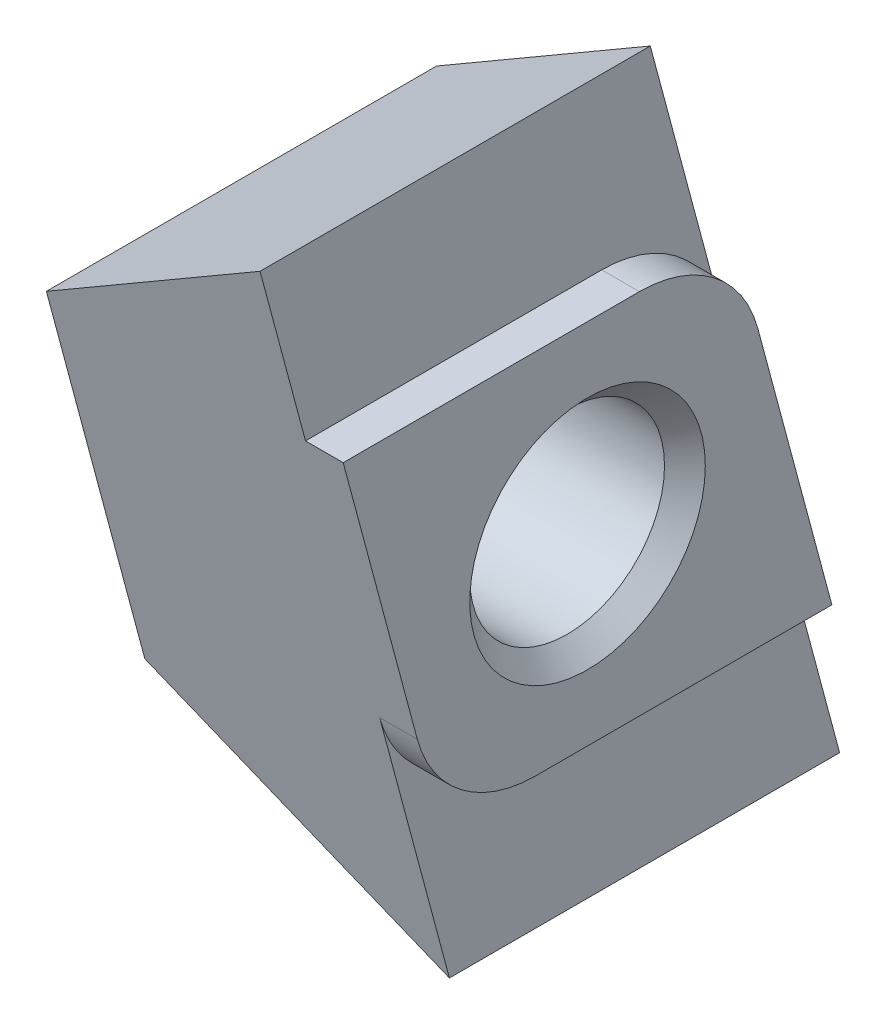
ISO-10303-21;
HEADER;
FILE_DESCRIPTION(('STEP AP214'),'2;1');
FILE_NAME('part.step','',(''),(''),'','','');
FILE_SCHEMA(('AUTOMOTIVE_DESIGN { 1 0 10303 214 1 1 1 1 }'));
ENDSEC;
DATA;
#1=APPLICATION_CONTEXT('core data for automotive mechanical design processes');
#2=APPLICATION_PROTOCOL_DEFINITION('international standard','automotive_design',2000,#1);
#3=PRODUCT_CONTEXT('',#1,'mechanical');
#4=PRODUCT('Part','Part','',(#3));
#5=PRODUCT_RELATED_PRODUCT_CATEGORY('part','',(#4));
#6=PRODUCT_DEFINITION_FORMATION('','',#4);
#7=PRODUCT_DEFINITION_CONTEXT('part definition',#1,'design');
#8=PRODUCT_DEFINITION('design','',#6,#7);
#9=PRODUCT_DEFINITION_SHAPE('','',#8);
#10=(LENGTH_UNIT() NAMED_UNIT(*) SI_UNIT(.MILLI.,.METRE.));
#11=(NAMED_UNIT(*) PLANE_ANGLE_UNIT() SI_UNIT($,.RADIAN.));
#12=(NAMED_UNIT(*) SI_UNIT($,.STERADIAN.) SOLID_ANGLE_UNIT());
#13=UNCERTAINTY_MEASURE_WITH_UNIT(LENGTH_MEASURE(1.E-05),#10,'distance_accuracy_value','');
#14=(GEOMETRIC_REPRESENTATION_CONTEXT(3) GLOBAL_UNCERTAINTY_ASSIGNED_CONTEXT((#13)) GLOBAL_UNIT_ASSIGNED_CONTEXT((#10,
#11,#12)) REPRESENTATION_CONTEXT('',''));
#15=CARTESIAN_POINT('',(0.,0.,0.));
#16=DIRECTION('',(0.,0.,1.));
#17=DIRECTION('',(1.,0.,0.));
#18=AXIS2_PLACEMENT_3D('',#15,#16,#17);
#19=CARTESIAN_POINT('',(-0.800000000000001,1.29999999999999,-1.10105270241365));
#20=DIRECTION('',(1.,0.,0.));
#21=DIRECTION('',(0.,0.,-1.));
#22=AXIS2_PLACEMENT_3D('',#19,#20,#21);
#23=CYLINDRICAL_SURFACE('',#22,2.60000000000001);
#24=CARTESIAN_POINT('',(0.,1.29999999999999,-1.10105270241365));
#25=DIRECTION('',(1.,0.,0.));
#26=DIRECTION('',(0.,0.,-1.));
#27=AXIS2_PLACEMENT_3D('',#24,#25,#26);
#28=CIRCLE('',#27,2.60000000000001);
#29=CARTESIAN_POINT('',(0.,1.97292951726655,-3.61245985076524));
#30=VERTEX_POINT('',#29);
#31=CARTESIAN_POINT('',(0.,3.9,-1.10105270241365));
#32=VERTEX_POINT('',#31);
#33=EDGE_CURVE('E150',#30,#32,#28,.T.);
#34=ORIENTED_EDGE('',*,*,#33,.F.);
#35=DIRECTION('',(1.,0.,0.));
#36=VECTOR('',#35,1.);
#37=CARTESIAN_POINT('',(-0.800000000000001,1.97292951726655,-3.61245985076524));
#38=LINE('',#37,#36);
#39=CARTESIAN_POINT('',(-0.800000000000001,1.97292951726655,-3.61245985076523));
#40=VERTEX_POINT('',#39);
#41=EDGE_CURVE('E168',#40,#30,#38,.T.);
#42=ORIENTED_EDGE('',*,*,#41,.F.);
#43=CARTESIAN_POINT('',(-0.800000000000001,1.29999999999999,-1.10105270241365));
#44=DIRECTION('',(1.,0.,0.));
#45=DIRECTION('',(0.,0.,-1.));
#46=AXIS2_PLACEMENT_3D('',#43,#44,#45);
#47=CIRCLE('',#46,2.60000000000001);
#48=CARTESIAN_POINT('',(-0.800000000000001,3.9,-1.10105270241365));
#49=VERTEX_POINT('',#48);
#50=EDGE_CURVE('E136',#40,#49,#47,.T.);
#51=ORIENTED_EDGE('',*,*,#50,.T.);
#52=DIRECTION('',(1.,0.,0.));
#53=VECTOR('',#52,1.);
#54=CARTESIAN_POINT('',(-0.800000000000001,3.9,-1.10105270241365));
#55=LINE('',#54,#53);
#56=EDGE_CURVE('E120',#49,#32,#55,.T.);
#57=ORIENTED_EDGE('',*,*,#56,.T.);
#58=EDGE_LOOP('',(#34,#42,#51,#57));
#59=FACE_BOUND('',#58,.T.);
#60=ADVANCED_FACE('F33',(#59),#23,.T.);
#61=CARTESIAN_POINT('',(-0.800000000000001,-3.9,-5.18610657212171));
#62=DIRECTION('',(0.,0.25881904510252,-0.965925826289068));
#63=DIRECTION('',(0.,0.965925826289068,0.25881904510252));
#64=AXIS2_PLACEMENT_3D('',#61,#62,#63);
#65=PLANE('',#64);
#66=DIRECTION('',(0.,0.965925826289068,0.25881904510252));
#67=VECTOR('',#66,1.);
#68=CARTESIAN_POINT('',(0.,-3.9,-5.18610657212171));
#69=LINE('',#68,#67);
#70=CARTESIAN_POINT('',(0.,-3.9,-5.18610657212171));
#71=VERTEX_POINT('',#70);
#72=EDGE_CURVE('E274',#71,#30,#69,.T.);
#73=ORIENTED_EDGE('',*,*,#72,.F.);
#74=DIRECTION('',(1.,0.,0.));
#75=VECTOR('',#74,1.);
#76=CARTESIAN_POINT('',(-0.800000000000001,-3.9,-5.18610657212171));
#77=LINE('',#76,#75);
#78=CARTESIAN_POINT('',(-0.800000000000001,-3.9,-5.18610657212171));
#79=VERTEX_POINT('',#78);
#80=EDGE_CURVE('E130',#79,#71,#77,.T.);
#81=ORIENTED_EDGE('',*,*,#80,.F.);
#82=CARTESIAN_POINT('',(-0.800000000000001,7.5,-2.13148577840691));
#83=CARTESIAN_POINT('',(-0.800000000000001,2.5,-3.47123174056252));
#84=CARTESIAN_POINT('',(-0.800000000000001,-2.5,-4.81097770271814));
#85=CARTESIAN_POINT('',(-0.800000000000001,-7.5,-6.15072366487375));
#86=B_SPLINE_CURVE_WITH_KNOTS('',3,(#82,#83,#84,#85),.UNSPECIFIED.,.F.,.F.,(4,4),(0.,1.),.UNSPECIFIED.);
#87=CARTESIAN_POINT('',(-0.800000000000001,-7.5,-6.15072366487375));
#88=VERTEX_POINT('',#87);
#89=EDGE_CURVE('E117',#79,#88,#86,.T.);
#90=ORIENTED_EDGE('',*,*,#89,.T.);
#91=DIRECTION('',(-0.827835666345006,0.541856072516727,0.145189897044757));
#92=VECTOR('',#91,1.);
#93=CARTESIAN_POINT('',(-2.53078460239917,-6.36712280570237,-5.84717013553806));
#94=LINE('',#93,#92);
#95=CARTESIAN_POINT('',(-6.3,-3.90000000000003,-5.18610657212172));
#96=VERTEX_POINT('',#95);
#97=EDGE_CURVE('E157',#96,#88,#94,.F.);
#98=ORIENTED_EDGE('',*,*,#97,.F.);
#99=CARTESIAN_POINT('',(-6.3,7.5,-2.13148577840691));
#100=CARTESIAN_POINT('',(-6.3,2.5,-3.47123174056252));
#101=CARTESIAN_POINT('',(-6.3,-2.5,-4.81097770271814));
#102=CARTESIAN_POINT('',(-6.3,-7.5,-6.15072366487375));
#103=B_SPLINE_CURVE_WITH_KNOTS('',3,(#99,#100,#101,#102),.UNSPECIFIED.,.F.,.F.,(4,4),(0.,1.),.UNSPECIFIED.);
#104=CARTESIAN_POINT('',(-6.3,3.90000000000003,-3.09610287115894));
#105=VERTEX_POINT('',#104);
#106=EDGE_CURVE('E84',#105,#96,#103,.T.);
#107=ORIENTED_EDGE('',*,*,#106,.F.);
#108=DIRECTION('',(-0.827835666345006,-0.541856072516727,-0.145189897044757));
#109=VECTOR('',#108,1.);
#110=CARTESIAN_POINT('',(-0.8,7.5,-2.13148577840691));
#111=LINE('',#110,#109);
#112=CARTESIAN_POINT('',(-0.800000000000001,7.5,-2.13148577840691));
#113=VERTEX_POINT('',#112);
#114=EDGE_CURVE('E151',#105,#113,#111,.F.);
#115=ORIENTED_EDGE('',*,*,#114,.T.);
#116=EDGE_CURVE('E224',#113,#40,#86,.T.);
#117=ORIENTED_EDGE('',*,*,#116,.T.);
#118=ORIENTED_EDGE('',*,*,#41,.T.);
#119=EDGE_LOOP('',(#73,#81,#90,#98,#107,#115,#117,#118));
#120=FACE_BOUND('',#119,.T.);
#121=ADVANCED_FACE('F194',(#120),#65,.T.);
#122=CARTESIAN_POINT('',(-0.800000000000001,-3.9,1.10105270241365));
#123=DIRECTION('',(0.,-1.,0.));
#124=DIRECTION('',(0.,0.,-1.));
#125=AXIS2_PLACEMENT_3D('',#122,#123,#124);
#126=PLANE('',#125);
#127=DIRECTION('',(0.,0.,-1.));
#128=VECTOR('',#127,1.);
#129=CARTESIAN_POINT('',(0.,-3.9,1.10105270241365));
#130=LINE('',#129,#128);
#131=CARTESIAN_POINT('',(0.,-3.9,1.10105270241365));
#132=VERTEX_POINT('',#131);
#133=EDGE_CURVE('E126',#132,#71,#130,.T.);
#134=ORIENTED_EDGE('',*,*,#133,.F.);
#135=DIRECTION('',(1.,0.,0.));
#136=VECTOR('',#135,1.);
#137=CARTESIAN_POINT('',(-0.800000000000001,-3.9,1.10105270241365));
#138=LINE('',#137,#136);
#139=CARTESIAN_POINT('',(-0.800000000000001,-3.9,1.10105270241365));
#140=VERTEX_POINT('',#139);
#141=EDGE_CURVE('E123',#140,#132,#138,.T.);
#142=ORIENTED_EDGE('',*,*,#141,.F.);
#143=DIRECTION('',(0.,0.,-1.));
#144=VECTOR('',#143,1.);
#145=CARTESIAN_POINT('',(-0.800000000000001,-3.9,1.10105270241365));
#146=LINE('',#145,#144);
#147=EDGE_CURVE('E112',#140,#79,#146,.T.);
#148=ORIENTED_EDGE('',*,*,#147,.T.);
#149=ORIENTED_EDGE('',*,*,#80,.T.);
#150=EDGE_LOOP('',(#134,#142,#148,#149));
#151=FACE_BOUND('',#150,.T.);
#152=ADVANCED_FACE('F124',(#151),#126,.T.);
#153=CARTESIAN_POINT('',(-0.800000000000001,-1.3,1.10105270241365));
#154=DIRECTION('',(1.,0.,0.));
#155=DIRECTION('',(0.,0.,-1.));
#156=AXIS2_PLACEMENT_3D('',#153,#154,#155);
#157=CYLINDRICAL_SURFACE('',#156,2.6);
#158=CARTESIAN_POINT('',(0.,-1.3,1.10105270241365));
#159=DIRECTION('',(1.,0.,0.));
#160=DIRECTION('',(0.,0.,-1.));
#161=AXIS2_PLACEMENT_3D('',#158,#159,#160);
#162=CIRCLE('',#161,2.6);
#163=CARTESIAN_POINT('',(0.,-1.97292951726655,3.61245985076523));
#164=VERTEX_POINT('',#163);
#165=EDGE_CURVE('E288',#164,#132,#162,.T.);
#166=ORIENTED_EDGE('',*,*,#165,.F.);
#167=DIRECTION('',(1.,0.,0.));
#168=VECTOR('',#167,1.);
#169=CARTESIAN_POINT('',(-0.800000000000001,-1.97292951726655,3.61245985076523));
#170=LINE('',#169,#168);
#171=CARTESIAN_POINT('',(-0.800000000000001,-1.97292951726656,3.61245985076523));
#172=VERTEX_POINT('',#171);
#173=EDGE_CURVE('E131',#172,#164,#170,.T.);
#174=ORIENTED_EDGE('',*,*,#173,.F.);
#175=CARTESIAN_POINT('',(-0.800000000000001,-1.3,1.10105270241365));
#176=DIRECTION('',(1.,0.,0.));
#177=DIRECTION('',(0.,0.,-1.));
#178=AXIS2_PLACEMENT_3D('',#175,#176,#177);
#179=CIRCLE('',#178,2.6);
#180=EDGE_CURVE('E98',#172,#140,#179,.T.);
#181=ORIENTED_EDGE('',*,*,#180,.T.);
#182=ORIENTED_EDGE('',*,*,#141,.T.);
#183=EDGE_LOOP('',(#166,#174,#181,#182));
#184=FACE_BOUND('',#183,.T.);
#185=ADVANCED_FACE('F134',(#184),#157,.T.);
#186=CARTESIAN_POINT('',(-0.800000000000001,3.9,5.18610657212171));
#187=DIRECTION('',(0.,-0.258819045102521,0.965925826289068));
#188=DIRECTION('',(0.,-0.965925826289068,-0.258819045102521));
#189=AXIS2_PLACEMENT_3D('',#186,#187,#188);
#190=PLANE('',#189);
#191=DIRECTION('',(0.,-0.965925826289068,-0.258819045102521));
#192=VECTOR('',#191,1.);
#193=CARTESIAN_POINT('',(0.,3.9,5.18610657212171));
#194=LINE('',#193,#192);
#195=CARTESIAN_POINT('',(0.,3.9,5.18610657212171));
#196=VERTEX_POINT('',#195);
#197=EDGE_CURVE('E294',#196,#164,#194,.T.);
#198=ORIENTED_EDGE('',*,*,#197,.F.);
#199=DIRECTION('',(1.,0.,0.));
#200=VECTOR('',#199,1.);
#201=CARTESIAN_POINT('',(-0.800000000000001,3.9,5.18610657212171));
#202=LINE('',#201,#200);
#203=CARTESIAN_POINT('',(-0.800000000000001,3.9,5.18610657212171));
#204=VERTEX_POINT('',#203);
#205=EDGE_CURVE('E144',#204,#196,#202,.T.);
#206=ORIENTED_EDGE('',*,*,#205,.F.);
#207=CARTESIAN_POINT('',(-0.800000000000001,-7.5,2.13148577840691));
#208=CARTESIAN_POINT('',(-0.800000000000001,-2.5,3.47123174056252));
#209=CARTESIAN_POINT('',(-0.800000000000001,2.5,4.81097770271814));
#210=CARTESIAN_POINT('',(-0.800000000000001,7.5,6.15072366487375));
#211=B_SPLINE_CURVE_WITH_KNOTS('',3,(#207,#208,#209,#210),.UNSPECIFIED.,.F.,.F.,(4,4),(0.,1.),.UNSPECIFIED.);
#212=CARTESIAN_POINT('',(-0.800000000000001,7.5,6.15072366487375));
#213=VERTEX_POINT('',#212);
#214=EDGE_CURVE('E50',#204,#213,#211,.T.);
#215=ORIENTED_EDGE('',*,*,#214,.T.);
#216=DIRECTION('',(-0.827835666345006,-0.541856072516727,-0.145189897044757));
#217=VECTOR('',#216,1.);
#218=CARTESIAN_POINT('',(-2.53078460239917,6.36712280570237,5.84717013553807));
#219=LINE('',#218,#217);
#220=CARTESIAN_POINT('',(-6.3,3.90000000000003,5.18610657212172));
#221=VERTEX_POINT('',#220);
#222=EDGE_CURVE('E147',#221,#213,#219,.F.);
#223=ORIENTED_EDGE('',*,*,#222,.F.);
#224=CARTESIAN_POINT('',(-6.3,-7.5,2.13148577840691));
#225=CARTESIAN_POINT('',(-6.3,-2.5,3.47123174056252));
#226=CARTESIAN_POINT('',(-6.3,2.5,4.81097770271814));
#227=CARTESIAN_POINT('',(-6.3,7.5,6.15072366487375));
#228=B_SPLINE_CURVE_WITH_KNOTS('',3,(#224,#225,#226,#227),.UNSPECIFIED.,.F.,.F.,(4,4),(0.,1.),.UNSPECIFIED.);
#229=CARTESIAN_POINT('',(-6.3,-3.90000000000003,3.09610287115894));
#230=VERTEX_POINT('',#229);
#231=EDGE_CURVE('E154',#230,#221,#228,.T.);
#232=ORIENTED_EDGE('',*,*,#231,.F.);
#233=DIRECTION('',(-0.827835666345006,0.541856072516727,0.145189897044757));
#234=VECTOR('',#233,1.);
#235=CARTESIAN_POINT('',(-0.800000000000001,-7.5,2.1314857784069));
#236=LINE('',#235,#234);
#237=CARTESIAN_POINT('',(-0.800000000000001,-7.5,2.13148577840691));
#238=VERTEX_POINT('',#237);
#239=EDGE_CURVE('E160',#230,#238,#236,.F.);
#240=ORIENTED_EDGE('',*,*,#239,.T.);
#241=EDGE_CURVE('E229',#238,#172,#211,.T.);
#242=ORIENTED_EDGE('',*,*,#241,.T.);
#243=ORIENTED_EDGE('',*,*,#173,.T.);
#244=EDGE_LOOP('',(#198,#206,#215,#223,#232,#240,#242,#243));
#245=FACE_BOUND('',#244,.T.);
#246=ADVANCED_FACE('F228',(#245),#190,.T.);
#247=CARTESIAN_POINT('',(-0.800000000000001,3.9,-1.10105270241365));
#248=DIRECTION('',(0.,1.,0.));
#249=DIRECTION('',(0.,0.,1.));
#250=AXIS2_PLACEMENT_3D('',#247,#248,#249);
#251=PLANE('',#250);
#252=DIRECTION('',(0.,0.,1.));
#253=VECTOR('',#252,1.);
#254=CARTESIAN_POINT('',(0.,3.9,-1.10105270241365));
#255=LINE('',#254,#253);
#256=EDGE_CURVE('E292',#32,#196,#255,.T.);
#257=ORIENTED_EDGE('',*,*,#256,.F.);
#258=ORIENTED_EDGE('',*,*,#56,.F.);
#259=DIRECTION('',(0.,0.,1.));
#260=VECTOR('',#259,1.);
#261=CARTESIAN_POINT('',(-0.800000000000001,3.9,-1.10105270241365));
#262=LINE('',#261,#260);
#263=EDGE_CURVE('E109',#49,#204,#262,.T.);
#264=ORIENTED_EDGE('',*,*,#263,.T.);
#265=ORIENTED_EDGE('',*,*,#205,.T.);
#266=EDGE_LOOP('',(#257,#258,#264,#265));
#267=FACE_BOUND('',#266,.T.);
#268=ADVANCED_FACE('F205',(#267),#251,.T.);
#269=CARTESIAN_POINT('',(0.,1.29999999999999,-1.10105270241365));
#270=DIRECTION('',(1.,0.,0.));
#271=DIRECTION('',(0.,0.,-1.));
#272=AXIS2_PLACEMENT_3D('',#269,#270,#271);
#273=PLANE('',#272);
#274=CARTESIAN_POINT('',(0.,0.,0.));
#275=DIRECTION('',(1.,0.,0.));
#276=DIRECTION('',(0.,0.,-1.));
#277=AXIS2_PLACEMENT_3D('',#274,#275,#276);
#278=CIRCLE('',#277,2.49999999999967);
#279=CARTESIAN_POINT('',(0.,0.,-2.49999999999967));
#280=VERTEX_POINT('',#279);
#281=EDGE_CURVE('E42',#280,#280,#278,.F.);
#282=ORIENTED_EDGE('',*,*,#281,.T.);
#283=EDGE_LOOP('',(#282));
#284=FACE_BOUND('',#283,.T.);
#285=ORIENTED_EDGE('',*,*,#33,.T.);
#286=ORIENTED_EDGE('',*,*,#256,.T.);
#287=ORIENTED_EDGE('',*,*,#197,.T.);
#288=ORIENTED_EDGE('',*,*,#165,.T.);
#289=ORIENTED_EDGE('',*,*,#133,.T.);
#290=ORIENTED_EDGE('',*,*,#72,.T.);
#291=EDGE_LOOP('',(#285,#286,#287,#288,#289,#290));
#292=FACE_BOUND('',#291,.T.);
#293=ADVANCED_FACE('F173',(#284,#292),#273,.T.);
#294=CARTESIAN_POINT('',(-0.800000000000001,0.,4.14110472164033));
#295=DIRECTION('',(-1.,0.,0.));
#296=DIRECTION('',(0.,0.,1.));
#297=AXIS2_PLACEMENT_3D('',#294,#295,#296);
#298=PLANE('',#297);
#299=ORIENTED_EDGE('',*,*,#147,.F.);
#300=ORIENTED_EDGE('',*,*,#180,.F.);
#301=ORIENTED_EDGE('',*,*,#241,.F.);
#302=DIRECTION('',(0.,0.,1.));
#303=VECTOR('',#302,1.);
#304=CARTESIAN_POINT('',(-0.800000000000001,-7.5,2.13148577840691));
#305=LINE('',#304,#303);
#306=EDGE_CURVE('E221',#88,#238,#305,.T.);
#307=ORIENTED_EDGE('',*,*,#306,.F.);
#308=ORIENTED_EDGE('',*,*,#89,.F.);
#309=EDGE_LOOP('',(#299,#300,#301,#307,#308));
#310=FACE_BOUND('',#309,.T.);
#311=ADVANCED_FACE('F114',(#310),#298,.F.);
#312=CARTESIAN_POINT('',(-0.800000000000001,7.5,-2.13148577840691));
#313=DIRECTION('',(-0.547659174694385,0.836701516894206,0.));
#314=DIRECTION('',(-0.836701516894206,-0.547659174694385,0.));
#315=AXIS2_PLACEMENT_3D('',#312,#313,#314);
#316=PLANE('',#315);
#317=DIRECTION('',(0.,0.,-1.));
#318=VECTOR('',#317,1.);
#319=CARTESIAN_POINT('',(-0.800000000000001,7.5,-2.13148577840691));
#320=LINE('',#319,#318);
#321=EDGE_CURVE('E231',#213,#113,#320,.T.);
#322=ORIENTED_EDGE('',*,*,#321,.T.);
#323=ORIENTED_EDGE('',*,*,#114,.F.);
#324=DIRECTION('',(0.,0.,1.));
#325=VECTOR('',#324,1.);
#326=CARTESIAN_POINT('',(-6.3,3.90000000000003,-2.13148577840691));
#327=LINE('',#326,#325);
#328=EDGE_CURVE('E152',#221,#105,#327,.F.);
#329=ORIENTED_EDGE('',*,*,#328,.F.);
#330=ORIENTED_EDGE('',*,*,#222,.T.);
#331=EDGE_LOOP('',(#322,#323,#329,#330));
#332=FACE_BOUND('',#331,.T.);
#333=ADVANCED_FACE('F207',(#332),#316,.T.);
#334=CARTESIAN_POINT('',(-0.800000000000001,-7.5,2.13148577840691));
#335=DIRECTION('',(-0.547659174694385,-0.836701516894206,0.));
#336=DIRECTION('',(0.836701516894206,-0.547659174694385,0.));
#337=AXIS2_PLACEMENT_3D('',#334,#335,#336);
#338=PLANE('',#337);
#339=ORIENTED_EDGE('',*,*,#306,.T.);
#340=ORIENTED_EDGE('',*,*,#239,.F.);
#341=DIRECTION('',(0.,0.,-1.));
#342=VECTOR('',#341,1.);
#343=CARTESIAN_POINT('',(-6.3,-3.90000000000003,2.13148577840691));
#344=LINE('',#343,#342);
#345=EDGE_CURVE('E89',#96,#230,#344,.F.);
#346=ORIENTED_EDGE('',*,*,#345,.F.);
#347=ORIENTED_EDGE('',*,*,#97,.T.);
#348=EDGE_LOOP('',(#339,#340,#346,#347));
#349=FACE_BOUND('',#348,.T.);
#350=ADVANCED_FACE('F210',(#349),#338,.T.);
#351=CARTESIAN_POINT('',(-6.3,0.,4.14110472164033));
#352=DIRECTION('',(-1.,0.,0.));
#353=DIRECTION('',(0.,0.,1.));
#354=AXIS2_PLACEMENT_3D('',#351,#352,#353);
#355=PLANE('',#354);
#356=CARTESIAN_POINT('',(-6.3,0.,0.));
#357=DIRECTION('',(-1.,0.,0.));
#358=DIRECTION('',(0.,0.,1.));
#359=AXIS2_PLACEMENT_3D('',#356,#357,#358);
#360=CIRCLE('',#359,2.49999999999967);
#361=CARTESIAN_POINT('',(-6.3,0.,2.49999999999967));
#362=VERTEX_POINT('',#361);
#363=EDGE_CURVE('E11',#362,#362,#360,.F.);
#364=ORIENTED_EDGE('',*,*,#363,.T.);
#365=EDGE_LOOP('',(#364));
#366=FACE_BOUND('',#365,.T.);
#367=ORIENTED_EDGE('',*,*,#231,.T.);
#368=ORIENTED_EDGE('',*,*,#328,.T.);
#369=ORIENTED_EDGE('',*,*,#106,.T.);
#370=ORIENTED_EDGE('',*,*,#345,.T.);
#371=EDGE_LOOP('',(#367,#368,#369,#370));
#372=FACE_BOUND('',#371,.T.);
#373=ADVANCED_FACE('F213',(#366,#372),#355,.T.);
#374=ORIENTED_EDGE('',*,*,#50,.F.);
#375=ORIENTED_EDGE('',*,*,#116,.F.);
#376=ORIENTED_EDGE('',*,*,#321,.F.);
#377=ORIENTED_EDGE('',*,*,#214,.F.);
#378=ORIENTED_EDGE('',*,*,#263,.F.);
#379=EDGE_LOOP('',(#374,#375,#376,#377,#378));
#380=FACE_BOUND('',#379,.T.);
#381=ADVANCED_FACE('F184',(#380),#298,.F.);
#382=CARTESIAN_POINT('',(-6.3,0.,0.));
#383=DIRECTION('',(-1.,0.,0.));
#384=DIRECTION('',(0.,0.,1.));
#385=AXIS2_PLACEMENT_3D('',#382,#383,#384);
#386=CYLINDRICAL_SURFACE('',#385,2.067);
#387=CARTESIAN_POINT('',(-0.432999999999664,0.,0.));
#388=DIRECTION('',(1.,0.,0.));
#389=DIRECTION('',(0.,0.,-1.));
#390=AXIS2_PLACEMENT_3D('',#387,#388,#389);
#391=CIRCLE('',#390,2.067);
#392=CARTESIAN_POINT('',(-0.432999999999664,0.,-2.067));
#393=VERTEX_POINT('',#392);
#394=EDGE_CURVE('E167',#393,#393,#391,.T.);
#395=ORIENTED_EDGE('',*,*,#394,.T.);
#396=EDGE_LOOP('',(#395));
#397=FACE_BOUND('',#396,.T.);
#398=CARTESIAN_POINT('',(-5.86700000000033,0.,0.));
#399=DIRECTION('',(-1.,0.,0.));
#400=DIRECTION('',(0.,0.,1.));
#401=AXIS2_PLACEMENT_3D('',#398,#399,#400);
#402=CIRCLE('',#401,2.067);
#403=CARTESIAN_POINT('',(-5.86700000000033,0.,2.067));
#404=VERTEX_POINT('',#403);
#405=EDGE_CURVE('E164',#404,#404,#402,.T.);
#406=ORIENTED_EDGE('',*,*,#405,.T.);
#407=EDGE_LOOP('',(#406));
#408=FACE_BOUND('',#407,.T.);
#409=ADVANCED_FACE('F179',(#397,#408),#386,.F.);
#410=CARTESIAN_POINT('',(-0.432999999999664,0.,0.));
#411=DIRECTION('',(1.,0.,0.));
#412=DIRECTION('',(0.,0.,-1.));
#413=AXIS2_PLACEMENT_3D('',#410,#411,#412);
#414=CONICAL_SURFACE('',#413,2.067,0.785398163397452);
#415=ORIENTED_EDGE('',*,*,#281,.F.);
#416=EDGE_LOOP('',(#415));
#417=FACE_BOUND('',#416,.T.);
#418=ORIENTED_EDGE('',*,*,#394,.F.);
#419=EDGE_LOOP('',(#418));
#420=FACE_BOUND('',#419,.T.);
#421=ADVANCED_FACE('F176',(#417,#420),#414,.F.);
#422=CARTESIAN_POINT('',(-5.86700000000033,0.,0.));
#423=DIRECTION('',(-1.,0.,0.));
#424=DIRECTION('',(0.,0.,1.));
#425=AXIS2_PLACEMENT_3D('',#422,#423,#424);
#426=CONICAL_SURFACE('',#425,2.067,0.785398163397453);
#427=ORIENTED_EDGE('',*,*,#363,.F.);
#428=EDGE_LOOP('',(#427));
#429=FACE_BOUND('',#428,.T.);
#430=ORIENTED_EDGE('',*,*,#405,.F.);
#431=EDGE_LOOP('',(#430));
#432=FACE_BOUND('',#431,.T.);
#433=ADVANCED_FACE('F35',(#429,#432),#426,.F.);
#434=CLOSED_SHELL('',(#60,#121,#152,#185,#246,#268,#293,#311,#333,#350,#373,#381,#409,#421,#433));
#435=MANIFOLD_SOLID_BREP('B2',#434);
#436=ADVANCED_BREP_SHAPE_REPRESENTATION('',(#18,#435),#14);
#437=SHAPE_DEFINITION_REPRESENTATION(#9,#436);
ENDSEC;
END-ISO-10303-21;
